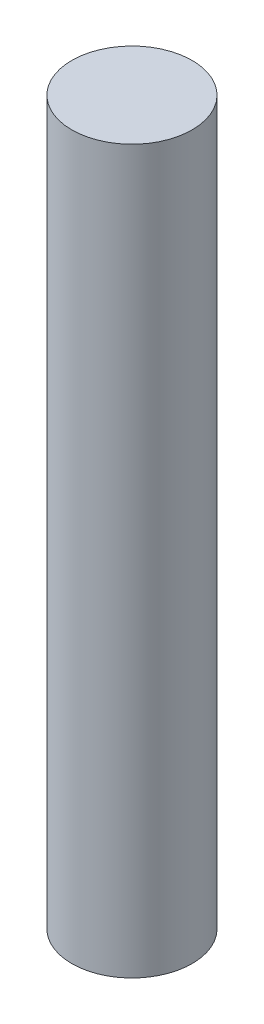
ISO-10303-21;
HEADER;
FILE_DESCRIPTION(('STEP AP214'),'2;1');
FILE_NAME('part.step','',(''),(''),'','','');
FILE_SCHEMA(('AUTOMOTIVE_DESIGN { 1 0 10303 214 1 1 1 1 }'));
ENDSEC;
DATA;
#1=APPLICATION_CONTEXT('core data for automotive mechanical design processes');
#2=APPLICATION_PROTOCOL_DEFINITION('international standard','automotive_design',2000,#1);
#3=PRODUCT_CONTEXT('',#1,'mechanical');
#4=PRODUCT('Part','Part','',(#3));
#5=PRODUCT_RELATED_PRODUCT_CATEGORY('part','',(#4));
#6=PRODUCT_DEFINITION_FORMATION('','',#4);
#7=PRODUCT_DEFINITION_CONTEXT('part definition',#1,'design');
#8=PRODUCT_DEFINITION('design','',#6,#7);
#9=PRODUCT_DEFINITION_SHAPE('','',#8);
#10=(LENGTH_UNIT() NAMED_UNIT(*) SI_UNIT(.MILLI.,.METRE.));
#11=(NAMED_UNIT(*) PLANE_ANGLE_UNIT() SI_UNIT($,.RADIAN.));
#12=(NAMED_UNIT(*) SI_UNIT($,.STERADIAN.) SOLID_ANGLE_UNIT());
#13=UNCERTAINTY_MEASURE_WITH_UNIT(LENGTH_MEASURE(1.E-05),#10,'distance_accuracy_value','');
#14=(GEOMETRIC_REPRESENTATION_CONTEXT(3) GLOBAL_UNCERTAINTY_ASSIGNED_CONTEXT((#13)) GLOBAL_UNIT_ASSIGNED_CONTEXT((#10,
#11,#12)) REPRESENTATION_CONTEXT('',''));
#15=CARTESIAN_POINT('',(0.,0.,0.));
#16=DIRECTION('',(0.,0.,1.));
#17=DIRECTION('',(1.,0.,0.));
#18=AXIS2_PLACEMENT_3D('',#15,#16,#17);
#19=CARTESIAN_POINT('',(-9.54545454545457,45.,4.4318181818182));
#20=DIRECTION('',(0.,-1.,0.));
#21=DIRECTION('',(0.,0.,-1.));
#22=AXIS2_PLACEMENT_3D('',#19,#20,#21);
#23=CYLINDRICAL_SURFACE('',#22,3.75);
#24=CARTESIAN_POINT('',(-9.54545454545457,45.,4.4318181818182));
#25=DIRECTION('',(0.,1.,0.));
#26=DIRECTION('',(0.,0.,1.));
#27=AXIS2_PLACEMENT_3D('',#24,#25,#26);
#28=CIRCLE('',#27,3.75);
#29=CARTESIAN_POINT('',(-9.54545454545457,45.,8.1818181818182));
#30=VERTEX_POINT('',#29);
#31=EDGE_CURVE('E10',#30,#30,#28,.T.);
#32=ORIENTED_EDGE('',*,*,#31,.F.);
#33=EDGE_LOOP('',(#32));
#34=FACE_BOUND('',#33,.T.);
#35=CARTESIAN_POINT('',(-9.54545454545457,0.,4.4318181818182));
#36=DIRECTION('',(0.,1.,0.));
#37=DIRECTION('',(0.,0.,1.));
#38=AXIS2_PLACEMENT_3D('',#35,#36,#37);
#39=CIRCLE('',#38,3.75);
#40=CARTESIAN_POINT('',(-9.54545454545457,0.,8.1818181818182));
#41=VERTEX_POINT('',#40);
#42=EDGE_CURVE('E35',#41,#41,#39,.T.);
#43=ORIENTED_EDGE('',*,*,#42,.T.);
#44=EDGE_LOOP('',(#43));
#45=FACE_BOUND('',#44,.T.);
#46=ADVANCED_FACE('F32',(#34,#45),#23,.T.);
#47=CARTESIAN_POINT('',(-9.54545454545457,45.,4.4318181818182));
#48=DIRECTION('',(0.,1.,0.));
#49=DIRECTION('',(0.,0.,1.));
#50=AXIS2_PLACEMENT_3D('',#47,#48,#49);
#51=PLANE('',#50);
#52=ORIENTED_EDGE('',*,*,#31,.T.);
#53=EDGE_LOOP('',(#52));
#54=FACE_BOUND('',#53,.T.);
#55=ADVANCED_FACE('F47',(#54),#51,.T.);
#56=CARTESIAN_POINT('',(-9.54545454545457,0.,4.4318181818182));
#57=DIRECTION('',(0.,1.,0.));
#58=DIRECTION('',(0.,0.,1.));
#59=AXIS2_PLACEMENT_3D('',#56,#57,#58);
#60=PLANE('',#59);
#61=ORIENTED_EDGE('',*,*,#42,.F.);
#62=EDGE_LOOP('',(#61));
#63=FACE_BOUND('',#62,.T.);
#64=ADVANCED_FACE('F45',(#63),#60,.F.);
#65=CLOSED_SHELL('',(#46,#55,#64));
#66=MANIFOLD_SOLID_BREP('B2',#65);
#67=ADVANCED_BREP_SHAPE_REPRESENTATION('',(#18,#66),#14);
#68=SHAPE_DEFINITION_REPRESENTATION(#9,#67);
ENDSEC;
END-ISO-10303-21;
